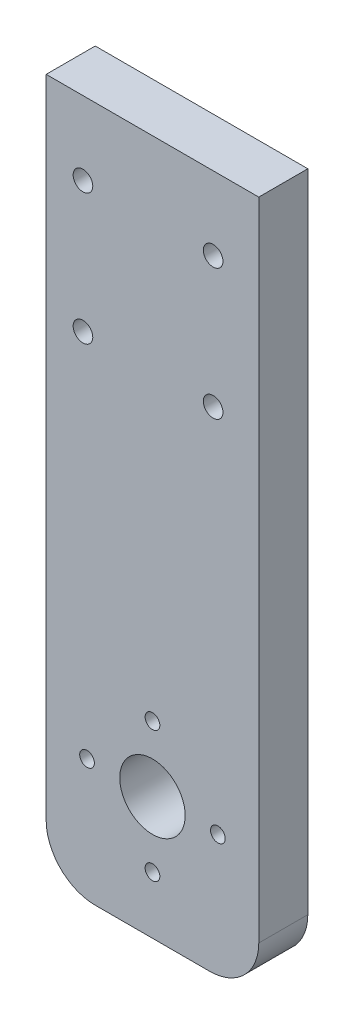
ISO-10303-21;
HEADER;
FILE_DESCRIPTION(('STEP AP214'),'2;1');
FILE_NAME('part.step','',(''),(''),'','','');
FILE_SCHEMA(('AUTOMOTIVE_DESIGN { 1 0 10303 214 1 1 1 1 }'));
ENDSEC;
DATA;
#1=APPLICATION_CONTEXT('core data for automotive mechanical design processes');
#2=APPLICATION_PROTOCOL_DEFINITION('international standard','automotive_design',2000,#1);
#3=PRODUCT_CONTEXT('',#1,'mechanical');
#4=PRODUCT('Part','Part','',(#3));
#5=PRODUCT_RELATED_PRODUCT_CATEGORY('part','',(#4));
#6=PRODUCT_DEFINITION_FORMATION('','',#4);
#7=PRODUCT_DEFINITION_CONTEXT('part definition',#1,'design');
#8=PRODUCT_DEFINITION('design','',#6,#7);
#9=PRODUCT_DEFINITION_SHAPE('','',#8);
#10=(LENGTH_UNIT() NAMED_UNIT(*) SI_UNIT(.MILLI.,.METRE.));
#11=(NAMED_UNIT(*) PLANE_ANGLE_UNIT() SI_UNIT($,.RADIAN.));
#12=(NAMED_UNIT(*) SI_UNIT($,.STERADIAN.) SOLID_ANGLE_UNIT());
#13=UNCERTAINTY_MEASURE_WITH_UNIT(LENGTH_MEASURE(1.E-05),#10,'distance_accuracy_value','');
#14=(GEOMETRIC_REPRESENTATION_CONTEXT(3) GLOBAL_UNCERTAINTY_ASSIGNED_CONTEXT((#13)) GLOBAL_UNIT_ASSIGNED_CONTEXT((#10,
#11,#12)) REPRESENTATION_CONTEXT('',''));
#15=CARTESIAN_POINT('',(0.,0.,0.));
#16=DIRECTION('',(0.,0.,1.));
#17=DIRECTION('',(1.,0.,0.));
#18=AXIS2_PLACEMENT_3D('',#15,#16,#17);
#19=CARTESIAN_POINT('',(44.9164343974426,-77.5734574949968,6.));
#20=DIRECTION('',(0.,0.,1.));
#21=DIRECTION('',(1.,0.,0.));
#22=AXIS2_PLACEMENT_3D('',#19,#20,#21);
#23=PLANE('',#22);
#24=CARTESIAN_POINT('',(29.4164343974426,-23.5734574949968,6.));
#25=DIRECTION('',(0.,0.,1.));
#26=DIRECTION('',(1.,0.,0.));
#27=AXIS2_PLACEMENT_3D('',#24,#25,#26);
#28=CIRCLE('',#27,1.2);
#29=CARTESIAN_POINT('',(30.6164343974426,-23.5734574949968,6.));
#30=VERTEX_POINT('',#29);
#31=EDGE_CURVE('E202',#30,#30,#28,.T.);
#32=ORIENTED_EDGE('',*,*,#31,.F.);
#33=EDGE_LOOP('',(#32));
#34=FACE_BOUND('',#33,.T.);
#35=CARTESIAN_POINT('',(45.3364343974426,-23.5734574949968,6.));
#36=DIRECTION('',(0.,0.,1.));
#37=DIRECTION('',(1.,0.,0.));
#38=AXIS2_PLACEMENT_3D('',#35,#36,#37);
#39=CIRCLE('',#38,1.2);
#40=CARTESIAN_POINT('',(46.5364343974426,-23.5734574949968,6.));
#41=VERTEX_POINT('',#40);
#42=EDGE_CURVE('E212',#41,#41,#39,.T.);
#43=ORIENTED_EDGE('',*,*,#42,.F.);
#44=EDGE_LOOP('',(#43));
#45=FACE_BOUND('',#44,.T.);
#46=CARTESIAN_POINT('',(29.4164343974426,-7.57345749499677,6.));
#47=DIRECTION('',(0.,0.,1.));
#48=DIRECTION('',(1.,0.,0.));
#49=AXIS2_PLACEMENT_3D('',#46,#47,#48);
#50=CIRCLE('',#49,1.2);
#51=CARTESIAN_POINT('',(30.6164343974426,-7.57345749499677,6.));
#52=VERTEX_POINT('',#51);
#53=EDGE_CURVE('E218',#52,#52,#50,.T.);
#54=ORIENTED_EDGE('',*,*,#53,.F.);
#55=EDGE_LOOP('',(#54));
#56=FACE_BOUND('',#55,.T.);
#57=CARTESIAN_POINT('',(45.3364343974426,-7.57345749499677,6.));
#58=DIRECTION('',(0.,0.,1.));
#59=DIRECTION('',(1.,0.,0.));
#60=AXIS2_PLACEMENT_3D('',#57,#58,#59);
#61=CIRCLE('',#60,1.2);
#62=CARTESIAN_POINT('',(46.5364343974426,-7.57345749499677,6.));
#63=VERTEX_POINT('',#62);
#64=EDGE_CURVE('E224',#63,#63,#61,.T.);
#65=ORIENTED_EDGE('',*,*,#64,.F.);
#66=EDGE_LOOP('',(#65));
#67=FACE_BOUND('',#66,.T.);
#68=CARTESIAN_POINT('',(37.9164343974426,-76.5734574949968,6.));
#69=DIRECTION('',(0.,0.,1.));
#70=DIRECTION('',(1.,0.,0.));
#71=AXIS2_PLACEMENT_3D('',#68,#69,#70);
#72=CIRCLE('',#71,0.899999999999996);
#73=CARTESIAN_POINT('',(38.8164343974426,-76.5734574949968,6.));
#74=VERTEX_POINT('',#73);
#75=EDGE_CURVE('E234',#74,#74,#72,.T.);
#76=ORIENTED_EDGE('',*,*,#75,.F.);
#77=EDGE_LOOP('',(#76));
#78=FACE_BOUND('',#77,.T.);
#79=CARTESIAN_POINT('',(37.9164343974426,-60.5734574949968,6.));
#80=DIRECTION('',(0.,0.,1.));
#81=DIRECTION('',(1.,0.,0.));
#82=AXIS2_PLACEMENT_3D('',#79,#80,#81);
#83=CIRCLE('',#82,0.899999999999996);
#84=CARTESIAN_POINT('',(38.8164343974426,-60.5734574949968,6.));
#85=VERTEX_POINT('',#84);
#86=EDGE_CURVE('E246',#85,#85,#83,.T.);
#87=ORIENTED_EDGE('',*,*,#86,.F.);
#88=EDGE_LOOP('',(#87));
#89=FACE_BOUND('',#88,.T.);
#90=CARTESIAN_POINT('',(44.9164343974426,-77.5734574949968,6.));
#91=DIRECTION('',(0.,0.,1.));
#92=DIRECTION('',(1.,0.,0.));
#93=AXIS2_PLACEMENT_3D('',#90,#91,#92);
#94=CIRCLE('',#93,6.);
#95=CARTESIAN_POINT('',(44.9164343974426,-83.5734574949968,6.));
#96=VERTEX_POINT('',#95);
#97=CARTESIAN_POINT('',(50.9164343974426,-77.5734574949968,6.));
#98=VERTEX_POINT('',#97);
#99=EDGE_CURVE('E131',#96,#98,#94,.T.);
#100=ORIENTED_EDGE('',*,*,#99,.T.);
#101=DIRECTION('',(0.,1.,0.));
#102=VECTOR('',#101,1.);
#103=CARTESIAN_POINT('',(50.9164343974426,-77.5734574949968,6.));
#104=LINE('',#103,#102);
#105=CARTESIAN_POINT('',(50.9164343974427,1.42654250500323,6.));
#106=VERTEX_POINT('',#105);
#107=EDGE_CURVE('E89',#98,#106,#104,.T.);
#108=ORIENTED_EDGE('',*,*,#107,.T.);
#109=DIRECTION('',(-1.,0.,0.));
#110=VECTOR('',#109,1.);
#111=CARTESIAN_POINT('',(50.9164343974427,1.42654250500323,6.));
#112=LINE('',#111,#110);
#113=CARTESIAN_POINT('',(24.9164343974426,1.42654250500322,6.));
#114=VERTEX_POINT('',#113);
#115=EDGE_CURVE('E102',#106,#114,#112,.T.);
#116=ORIENTED_EDGE('',*,*,#115,.T.);
#117=DIRECTION('',(0.,-1.,0.));
#118=VECTOR('',#117,1.);
#119=CARTESIAN_POINT('',(24.9164343974426,-77.5734574949968,6.));
#120=LINE('',#119,#118);
#121=CARTESIAN_POINT('',(24.9164343974426,-77.5734574949968,6.));
#122=VERTEX_POINT('',#121);
#123=EDGE_CURVE('E96',#114,#122,#120,.T.);
#124=ORIENTED_EDGE('',*,*,#123,.T.);
#125=CARTESIAN_POINT('',(30.9164343974426,-77.5734574949968,6.));
#126=DIRECTION('',(0.,0.,1.));
#127=DIRECTION('',(1.,0.,0.));
#128=AXIS2_PLACEMENT_3D('',#125,#126,#127);
#129=CIRCLE('',#128,6.);
#130=CARTESIAN_POINT('',(30.9164343974426,-83.5734574949968,6.));
#131=VERTEX_POINT('',#130);
#132=EDGE_CURVE('E100',#122,#131,#129,.T.);
#133=ORIENTED_EDGE('',*,*,#132,.T.);
#134=DIRECTION('',(1.,0.,0.));
#135=VECTOR('',#134,1.);
#136=CARTESIAN_POINT('',(30.9164343974426,-83.5734574949968,6.));
#137=LINE('',#136,#135);
#138=EDGE_CURVE('E52',#131,#96,#137,.T.);
#139=ORIENTED_EDGE('',*,*,#138,.T.);
#140=EDGE_LOOP('',(#100,#108,#116,#124,#133,#139));
#141=FACE_BOUND('',#140,.T.);
#142=CARTESIAN_POINT('',(29.9164343974426,-68.5734574949968,6.));
#143=DIRECTION('',(0.,0.,1.));
#144=DIRECTION('',(1.,0.,0.));
#145=AXIS2_PLACEMENT_3D('',#142,#143,#144);
#146=CIRCLE('',#145,0.899999999999996);
#147=CARTESIAN_POINT('',(30.8164343974426,-68.5734574949968,6.));
#148=VERTEX_POINT('',#147);
#149=EDGE_CURVE('E124',#148,#148,#146,.T.);
#150=ORIENTED_EDGE('',*,*,#149,.F.);
#151=EDGE_LOOP('',(#150));
#152=FACE_BOUND('',#151,.T.);
#153=CARTESIAN_POINT('',(45.9164343974426,-68.5734574949968,6.));
#154=DIRECTION('',(0.,0.,1.));
#155=DIRECTION('',(1.,0.,0.));
#156=AXIS2_PLACEMENT_3D('',#153,#154,#155);
#157=CIRCLE('',#156,0.899999999999996);
#158=CARTESIAN_POINT('',(46.8164343974426,-68.5734574949968,6.));
#159=VERTEX_POINT('',#158);
#160=EDGE_CURVE('E240',#159,#159,#157,.T.);
#161=ORIENTED_EDGE('',*,*,#160,.F.);
#162=EDGE_LOOP('',(#161));
#163=FACE_BOUND('',#162,.T.);
#164=CARTESIAN_POINT('',(37.9164343974426,-68.5734574949968,6.));
#165=DIRECTION('',(0.,0.,1.));
#166=DIRECTION('',(1.,0.,0.));
#167=AXIS2_PLACEMENT_3D('',#164,#165,#166);
#168=CIRCLE('',#167,4.00000000000001);
#169=CARTESIAN_POINT('',(41.9164343974426,-68.5734574949968,6.));
#170=VERTEX_POINT('',#169);
#171=EDGE_CURVE('E228',#170,#170,#168,.T.);
#172=ORIENTED_EDGE('',*,*,#171,.F.);
#173=EDGE_LOOP('',(#172));
#174=FACE_BOUND('',#173,.T.);
#175=ADVANCED_FACE('F35',(#34,#45,#56,#67,#78,#89,#141,#152,#163,#174),#23,.T.);
#176=CARTESIAN_POINT('',(44.9164343974426,-77.5734574949968,0.));
#177=DIRECTION('',(0.,0.,1.));
#178=DIRECTION('',(1.,0.,0.));
#179=AXIS2_PLACEMENT_3D('',#176,#177,#178);
#180=PLANE('',#179);
#181=CARTESIAN_POINT('',(29.4164343974426,-23.5734574949968,0.));
#182=DIRECTION('',(0.,0.,-1.));
#183=DIRECTION('',(-1.,0.,0.));
#184=AXIS2_PLACEMENT_3D('',#181,#182,#183);
#185=CIRCLE('',#184,1.2);
#186=CARTESIAN_POINT('',(28.2164343974426,-23.5734574949968,0.));
#187=VERTEX_POINT('',#186);
#188=EDGE_CURVE('E205',#187,#187,#185,.T.);
#189=ORIENTED_EDGE('',*,*,#188,.F.);
#190=EDGE_LOOP('',(#189));
#191=FACE_BOUND('',#190,.T.);
#192=CARTESIAN_POINT('',(45.3364343974426,-23.5734574949968,0.));
#193=DIRECTION('',(0.,0.,-1.));
#194=DIRECTION('',(-1.,0.,0.));
#195=AXIS2_PLACEMENT_3D('',#192,#193,#194);
#196=CIRCLE('',#195,1.2);
#197=CARTESIAN_POINT('',(44.1364343974426,-23.5734574949968,0.));
#198=VERTEX_POINT('',#197);
#199=EDGE_CURVE('E207',#198,#198,#196,.T.);
#200=ORIENTED_EDGE('',*,*,#199,.F.);
#201=EDGE_LOOP('',(#200));
#202=FACE_BOUND('',#201,.T.);
#203=CARTESIAN_POINT('',(29.4164343974426,-7.57345749499677,0.));
#204=DIRECTION('',(0.,0.,-1.));
#205=DIRECTION('',(-1.,0.,0.));
#206=AXIS2_PLACEMENT_3D('',#203,#204,#205);
#207=CIRCLE('',#206,1.2);
#208=CARTESIAN_POINT('',(28.2164343974426,-7.57345749499677,0.));
#209=VERTEX_POINT('',#208);
#210=EDGE_CURVE('E215',#209,#209,#207,.T.);
#211=ORIENTED_EDGE('',*,*,#210,.F.);
#212=EDGE_LOOP('',(#211));
#213=FACE_BOUND('',#212,.T.);
#214=CARTESIAN_POINT('',(45.3364343974426,-7.57345749499677,0.));
#215=DIRECTION('',(0.,0.,-1.));
#216=DIRECTION('',(-1.,0.,0.));
#217=AXIS2_PLACEMENT_3D('',#214,#215,#216);
#218=CIRCLE('',#217,1.2);
#219=CARTESIAN_POINT('',(44.1364343974426,-7.57345749499677,0.));
#220=VERTEX_POINT('',#219);
#221=EDGE_CURVE('E221',#220,#220,#218,.T.);
#222=ORIENTED_EDGE('',*,*,#221,.F.);
#223=EDGE_LOOP('',(#222));
#224=FACE_BOUND('',#223,.T.);
#225=CARTESIAN_POINT('',(44.9164343974426,-77.5734574949968,0.));
#226=DIRECTION('',(0.,0.,1.));
#227=DIRECTION('',(1.,0.,0.));
#228=AXIS2_PLACEMENT_3D('',#225,#226,#227);
#229=CIRCLE('',#228,6.);
#230=CARTESIAN_POINT('',(44.9164343974426,-83.5734574949968,0.));
#231=VERTEX_POINT('',#230);
#232=CARTESIAN_POINT('',(50.9164343974426,-77.5734574949968,0.));
#233=VERTEX_POINT('',#232);
#234=EDGE_CURVE('E120',#231,#233,#229,.T.);
#235=ORIENTED_EDGE('',*,*,#234,.F.);
#236=DIRECTION('',(1.,0.,0.));
#237=VECTOR('',#236,1.);
#238=CARTESIAN_POINT('',(30.9164343974426,-83.5734574949968,0.));
#239=LINE('',#238,#237);
#240=CARTESIAN_POINT('',(30.9164343974426,-83.5734574949968,0.));
#241=VERTEX_POINT('',#240);
#242=EDGE_CURVE('E81',#241,#231,#239,.T.);
#243=ORIENTED_EDGE('',*,*,#242,.F.);
#244=CARTESIAN_POINT('',(30.9164343974426,-77.5734574949968,0.));
#245=DIRECTION('',(0.,0.,1.));
#246=DIRECTION('',(1.,0.,0.));
#247=AXIS2_PLACEMENT_3D('',#244,#245,#246);
#248=CIRCLE('',#247,6.);
#249=CARTESIAN_POINT('',(24.9164343974426,-77.5734574949968,0.));
#250=VERTEX_POINT('',#249);
#251=EDGE_CURVE('E75',#250,#241,#248,.T.);
#252=ORIENTED_EDGE('',*,*,#251,.F.);
#253=DIRECTION('',(0.,-1.,0.));
#254=VECTOR('',#253,1.);
#255=CARTESIAN_POINT('',(24.9164343974426,-77.5734574949968,0.));
#256=LINE('',#255,#254);
#257=CARTESIAN_POINT('',(24.9164343974426,1.42654250500322,0.));
#258=VERTEX_POINT('',#257);
#259=EDGE_CURVE('E110',#258,#250,#256,.T.);
#260=ORIENTED_EDGE('',*,*,#259,.F.);
#261=DIRECTION('',(-1.,0.,0.));
#262=VECTOR('',#261,1.);
#263=CARTESIAN_POINT('',(50.9164343974427,1.42654250500323,0.));
#264=LINE('',#263,#262);
#265=CARTESIAN_POINT('',(50.9164343974427,1.42654250500323,0.));
#266=VERTEX_POINT('',#265);
#267=EDGE_CURVE('E126',#266,#258,#264,.T.);
#268=ORIENTED_EDGE('',*,*,#267,.F.);
#269=DIRECTION('',(0.,1.,0.));
#270=VECTOR('',#269,1.);
#271=CARTESIAN_POINT('',(50.9164343974426,-77.5734574949968,0.));
#272=LINE('',#271,#270);
#273=EDGE_CURVE('E123',#233,#266,#272,.T.);
#274=ORIENTED_EDGE('',*,*,#273,.F.);
#275=EDGE_LOOP('',(#235,#243,#252,#260,#268,#274));
#276=FACE_BOUND('',#275,.T.);
#277=CARTESIAN_POINT('',(29.9164343974426,-68.5734574949968,0.));
#278=DIRECTION('',(0.,0.,1.));
#279=DIRECTION('',(1.,0.,0.));
#280=AXIS2_PLACEMENT_3D('',#277,#278,#279);
#281=CIRCLE('',#280,0.899999999999996);
#282=CARTESIAN_POINT('',(30.8164343974426,-68.5734574949968,0.));
#283=VERTEX_POINT('',#282);
#284=EDGE_CURVE('E249',#283,#283,#281,.T.);
#285=ORIENTED_EDGE('',*,*,#284,.T.);
#286=EDGE_LOOP('',(#285));
#287=FACE_BOUND('',#286,.T.);
#288=CARTESIAN_POINT('',(37.9164343974426,-60.5734574949968,0.));
#289=DIRECTION('',(0.,0.,1.));
#290=DIRECTION('',(1.,0.,0.));
#291=AXIS2_PLACEMENT_3D('',#288,#289,#290);
#292=CIRCLE('',#291,0.899999999999996);
#293=CARTESIAN_POINT('',(38.8164343974426,-60.5734574949968,0.));
#294=VERTEX_POINT('',#293);
#295=EDGE_CURVE('E243',#294,#294,#292,.T.);
#296=ORIENTED_EDGE('',*,*,#295,.T.);
#297=EDGE_LOOP('',(#296));
#298=FACE_BOUND('',#297,.T.);
#299=CARTESIAN_POINT('',(45.9164343974426,-68.5734574949968,0.));
#300=DIRECTION('',(0.,0.,1.));
#301=DIRECTION('',(1.,0.,0.));
#302=AXIS2_PLACEMENT_3D('',#299,#300,#301);
#303=CIRCLE('',#302,0.899999999999996);
#304=CARTESIAN_POINT('',(46.8164343974426,-68.5734574949968,0.));
#305=VERTEX_POINT('',#304);
#306=EDGE_CURVE('E237',#305,#305,#303,.T.);
#307=ORIENTED_EDGE('',*,*,#306,.T.);
#308=EDGE_LOOP('',(#307));
#309=FACE_BOUND('',#308,.T.);
#310=CARTESIAN_POINT('',(37.9164343974426,-76.5734574949968,0.));
#311=DIRECTION('',(0.,0.,1.));
#312=DIRECTION('',(1.,0.,0.));
#313=AXIS2_PLACEMENT_3D('',#310,#311,#312);
#314=CIRCLE('',#313,0.899999999999996);
#315=CARTESIAN_POINT('',(38.8164343974426,-76.5734574949968,0.));
#316=VERTEX_POINT('',#315);
#317=EDGE_CURVE('E231',#316,#316,#314,.T.);
#318=ORIENTED_EDGE('',*,*,#317,.T.);
#319=EDGE_LOOP('',(#318));
#320=FACE_BOUND('',#319,.T.);
#321=CARTESIAN_POINT('',(37.9164343974426,-68.5734574949968,0.));
#322=DIRECTION('',(0.,0.,1.));
#323=DIRECTION('',(1.,0.,0.));
#324=AXIS2_PLACEMENT_3D('',#321,#322,#323);
#325=CIRCLE('',#324,4.00000000000001);
#326=CARTESIAN_POINT('',(41.9164343974426,-68.5734574949968,0.));
#327=VERTEX_POINT('',#326);
#328=EDGE_CURVE('E227',#327,#327,#325,.T.);
#329=ORIENTED_EDGE('',*,*,#328,.T.);
#330=EDGE_LOOP('',(#329));
#331=FACE_BOUND('',#330,.T.);
#332=ADVANCED_FACE('F140',(#191,#202,#213,#224,#276,#287,#298,#309,#320,#331),#180,.F.);
#333=CARTESIAN_POINT('',(44.9164343974426,-77.5734574949968,6.));
#334=DIRECTION('',(0.,0.,-1.));
#335=DIRECTION('',(-1.,0.,0.));
#336=AXIS2_PLACEMENT_3D('',#333,#334,#335);
#337=CYLINDRICAL_SURFACE('',#336,6.);
#338=ORIENTED_EDGE('',*,*,#234,.T.);
#339=DIRECTION('',(0.,0.,-1.));
#340=VECTOR('',#339,1.);
#341=CARTESIAN_POINT('',(50.9164343974426,-77.5734574949968,6.));
#342=LINE('',#341,#340);
#343=EDGE_CURVE('E11',#98,#233,#342,.T.);
#344=ORIENTED_EDGE('',*,*,#343,.F.);
#345=ORIENTED_EDGE('',*,*,#99,.F.);
#346=DIRECTION('',(0.,0.,-1.));
#347=VECTOR('',#346,1.);
#348=CARTESIAN_POINT('',(44.9164343974426,-83.5734574949968,6.));
#349=LINE('',#348,#347);
#350=EDGE_CURVE('E116',#96,#231,#349,.T.);
#351=ORIENTED_EDGE('',*,*,#350,.T.);
#352=EDGE_LOOP('',(#338,#344,#345,#351));
#353=FACE_BOUND('',#352,.T.);
#354=ADVANCED_FACE('F37',(#353),#337,.T.);
#355=CARTESIAN_POINT('',(50.9164343974426,-77.5734574949968,6.));
#356=DIRECTION('',(-1.,0.,0.));
#357=DIRECTION('',(0.,-1.,0.));
#358=AXIS2_PLACEMENT_3D('',#355,#356,#357);
#359=PLANE('',#358);
#360=ORIENTED_EDGE('',*,*,#273,.T.);
#361=DIRECTION('',(0.,0.,-1.));
#362=VECTOR('',#361,1.);
#363=CARTESIAN_POINT('',(50.9164343974427,1.42654250500323,6.));
#364=LINE('',#363,#362);
#365=EDGE_CURVE('E44',#106,#266,#364,.T.);
#366=ORIENTED_EDGE('',*,*,#365,.F.);
#367=ORIENTED_EDGE('',*,*,#107,.F.);
#368=ORIENTED_EDGE('',*,*,#343,.T.);
#369=EDGE_LOOP('',(#360,#366,#367,#368));
#370=FACE_BOUND('',#369,.T.);
#371=ADVANCED_FACE('F354',(#370),#359,.F.);
#372=CARTESIAN_POINT('',(50.9164343974427,1.42654250500323,6.));
#373=DIRECTION('',(0.,-1.,0.));
#374=DIRECTION('',(1.,0.,0.));
#375=AXIS2_PLACEMENT_3D('',#372,#373,#374);
#376=PLANE('',#375);
#377=ORIENTED_EDGE('',*,*,#267,.T.);
#378=DIRECTION('',(0.,0.,-1.));
#379=VECTOR('',#378,1.);
#380=CARTESIAN_POINT('',(24.9164343974426,1.42654250500322,6.));
#381=LINE('',#380,#379);
#382=EDGE_CURVE('E111',#114,#258,#381,.T.);
#383=ORIENTED_EDGE('',*,*,#382,.F.);
#384=ORIENTED_EDGE('',*,*,#115,.F.);
#385=ORIENTED_EDGE('',*,*,#365,.T.);
#386=EDGE_LOOP('',(#377,#383,#384,#385));
#387=FACE_BOUND('',#386,.T.);
#388=ADVANCED_FACE('F137',(#387),#376,.F.);
#389=CARTESIAN_POINT('',(24.9164343974426,-77.5734574949968,6.));
#390=DIRECTION('',(1.,0.,0.));
#391=DIRECTION('',(0.,1.,0.));
#392=AXIS2_PLACEMENT_3D('',#389,#390,#391);
#393=PLANE('',#392);
#394=ORIENTED_EDGE('',*,*,#259,.T.);
#395=DIRECTION('',(0.,0.,-1.));
#396=VECTOR('',#395,1.);
#397=CARTESIAN_POINT('',(24.9164343974426,-77.5734574949968,6.));
#398=LINE('',#397,#396);
#399=EDGE_CURVE('E107',#122,#250,#398,.T.);
#400=ORIENTED_EDGE('',*,*,#399,.F.);
#401=ORIENTED_EDGE('',*,*,#123,.F.);
#402=ORIENTED_EDGE('',*,*,#382,.T.);
#403=EDGE_LOOP('',(#394,#400,#401,#402));
#404=FACE_BOUND('',#403,.T.);
#405=ADVANCED_FACE('F108',(#404),#393,.F.);
#406=CARTESIAN_POINT('',(30.9164343974426,-77.5734574949968,6.));
#407=DIRECTION('',(0.,0.,-1.));
#408=DIRECTION('',(-1.,0.,0.));
#409=AXIS2_PLACEMENT_3D('',#406,#407,#408);
#410=CYLINDRICAL_SURFACE('',#409,6.);
#411=ORIENTED_EDGE('',*,*,#251,.T.);
#412=DIRECTION('',(0.,0.,-1.));
#413=VECTOR('',#412,1.);
#414=CARTESIAN_POINT('',(30.9164343974426,-83.5734574949968,6.));
#415=LINE('',#414,#413);
#416=EDGE_CURVE('E112',#131,#241,#415,.T.);
#417=ORIENTED_EDGE('',*,*,#416,.F.);
#418=ORIENTED_EDGE('',*,*,#132,.F.);
#419=ORIENTED_EDGE('',*,*,#399,.T.);
#420=EDGE_LOOP('',(#411,#417,#418,#419));
#421=FACE_BOUND('',#420,.T.);
#422=ADVANCED_FACE('F114',(#421),#410,.T.);
#423=CARTESIAN_POINT('',(30.9164343974426,-83.5734574949968,6.));
#424=DIRECTION('',(0.,1.,0.));
#425=DIRECTION('',(0.,0.,1.));
#426=AXIS2_PLACEMENT_3D('',#423,#424,#425);
#427=PLANE('',#426);
#428=ORIENTED_EDGE('',*,*,#242,.T.);
#429=ORIENTED_EDGE('',*,*,#350,.F.);
#430=ORIENTED_EDGE('',*,*,#138,.F.);
#431=ORIENTED_EDGE('',*,*,#416,.T.);
#432=EDGE_LOOP('',(#428,#429,#430,#431));
#433=FACE_BOUND('',#432,.T.);
#434=ADVANCED_FACE('F145',(#433),#427,.F.);
#435=CARTESIAN_POINT('',(29.9164343974426,-68.5734574949968,6.));
#436=DIRECTION('',(0.,0.,-1.));
#437=DIRECTION('',(-1.,0.,0.));
#438=AXIS2_PLACEMENT_3D('',#435,#436,#437);
#439=CYLINDRICAL_SURFACE('',#438,0.899999999999996);
#440=ORIENTED_EDGE('',*,*,#149,.T.);
#441=EDGE_LOOP('',(#440));
#442=FACE_BOUND('',#441,.T.);
#443=ORIENTED_EDGE('',*,*,#284,.F.);
#444=EDGE_LOOP('',(#443));
#445=FACE_BOUND('',#444,.T.);
#446=ADVANCED_FACE('F147',(#442,#445),#439,.F.);
#447=CARTESIAN_POINT('',(37.9164343974426,-60.5734574949968,6.));
#448=DIRECTION('',(0.,0.,-1.));
#449=DIRECTION('',(-1.,0.,0.));
#450=AXIS2_PLACEMENT_3D('',#447,#448,#449);
#451=CYLINDRICAL_SURFACE('',#450,0.899999999999996);
#452=ORIENTED_EDGE('',*,*,#86,.T.);
#453=EDGE_LOOP('',(#452));
#454=FACE_BOUND('',#453,.T.);
#455=ORIENTED_EDGE('',*,*,#295,.F.);
#456=EDGE_LOOP('',(#455));
#457=FACE_BOUND('',#456,.T.);
#458=ADVANCED_FACE('F153',(#454,#457),#451,.F.);
#459=CARTESIAN_POINT('',(45.9164343974426,-68.5734574949968,6.));
#460=DIRECTION('',(0.,0.,-1.));
#461=DIRECTION('',(-1.,0.,0.));
#462=AXIS2_PLACEMENT_3D('',#459,#460,#461);
#463=CYLINDRICAL_SURFACE('',#462,0.899999999999996);
#464=ORIENTED_EDGE('',*,*,#160,.T.);
#465=EDGE_LOOP('',(#464));
#466=FACE_BOUND('',#465,.T.);
#467=ORIENTED_EDGE('',*,*,#306,.F.);
#468=EDGE_LOOP('',(#467));
#469=FACE_BOUND('',#468,.T.);
#470=ADVANCED_FACE('F170',(#466,#469),#463,.F.);
#471=CARTESIAN_POINT('',(37.9164343974426,-76.5734574949968,6.));
#472=DIRECTION('',(0.,0.,-1.));
#473=DIRECTION('',(-1.,0.,0.));
#474=AXIS2_PLACEMENT_3D('',#471,#472,#473);
#475=CYLINDRICAL_SURFACE('',#474,0.899999999999996);
#476=ORIENTED_EDGE('',*,*,#75,.T.);
#477=EDGE_LOOP('',(#476));
#478=FACE_BOUND('',#477,.T.);
#479=ORIENTED_EDGE('',*,*,#317,.F.);
#480=EDGE_LOOP('',(#479));
#481=FACE_BOUND('',#480,.T.);
#482=ADVANCED_FACE('F174',(#478,#481),#475,.F.);
#483=CARTESIAN_POINT('',(37.9164343974426,-68.5734574949968,6.));
#484=DIRECTION('',(0.,0.,-1.));
#485=DIRECTION('',(-1.,0.,0.));
#486=AXIS2_PLACEMENT_3D('',#483,#484,#485);
#487=CYLINDRICAL_SURFACE('',#486,4.00000000000001);
#488=ORIENTED_EDGE('',*,*,#171,.T.);
#489=EDGE_LOOP('',(#488));
#490=FACE_BOUND('',#489,.T.);
#491=ORIENTED_EDGE('',*,*,#328,.F.);
#492=EDGE_LOOP('',(#491));
#493=FACE_BOUND('',#492,.T.);
#494=ADVANCED_FACE('F178',(#490,#493),#487,.F.);
#495=CARTESIAN_POINT('',(45.3364343974426,-7.57345749499677,10.));
#496=DIRECTION('',(0.,0.,-1.));
#497=DIRECTION('',(-1.,0.,0.));
#498=AXIS2_PLACEMENT_3D('',#495,#496,#497);
#499=CYLINDRICAL_SURFACE('',#498,1.2);
#500=ORIENTED_EDGE('',*,*,#64,.T.);
#501=EDGE_LOOP('',(#500));
#502=FACE_BOUND('',#501,.T.);
#503=ORIENTED_EDGE('',*,*,#221,.T.);
#504=EDGE_LOOP('',(#503));
#505=FACE_BOUND('',#504,.T.);
#506=ADVANCED_FACE('F182',(#502,#505),#499,.F.);
#507=CARTESIAN_POINT('',(29.4164343974426,-7.57345749499677,10.));
#508=DIRECTION('',(0.,0.,-1.));
#509=DIRECTION('',(-1.,0.,0.));
#510=AXIS2_PLACEMENT_3D('',#507,#508,#509);
#511=CYLINDRICAL_SURFACE('',#510,1.2);
#512=ORIENTED_EDGE('',*,*,#53,.T.);
#513=EDGE_LOOP('',(#512));
#514=FACE_BOUND('',#513,.T.);
#515=ORIENTED_EDGE('',*,*,#210,.T.);
#516=EDGE_LOOP('',(#515));
#517=FACE_BOUND('',#516,.T.);
#518=ADVANCED_FACE('F186',(#514,#517),#511,.F.);
#519=CARTESIAN_POINT('',(45.3364343974426,-23.5734574949968,10.));
#520=DIRECTION('',(0.,0.,-1.));
#521=DIRECTION('',(-1.,0.,0.));
#522=AXIS2_PLACEMENT_3D('',#519,#520,#521);
#523=CYLINDRICAL_SURFACE('',#522,1.2);
#524=ORIENTED_EDGE('',*,*,#42,.T.);
#525=EDGE_LOOP('',(#524));
#526=FACE_BOUND('',#525,.T.);
#527=ORIENTED_EDGE('',*,*,#199,.T.);
#528=EDGE_LOOP('',(#527));
#529=FACE_BOUND('',#528,.T.);
#530=ADVANCED_FACE('F190',(#526,#529),#523,.F.);
#531=CARTESIAN_POINT('',(29.4164343974426,-23.5734574949968,10.));
#532=DIRECTION('',(0.,0.,-1.));
#533=DIRECTION('',(-1.,0.,0.));
#534=AXIS2_PLACEMENT_3D('',#531,#532,#533);
#535=CYLINDRICAL_SURFACE('',#534,1.2);
#536=ORIENTED_EDGE('',*,*,#31,.T.);
#537=EDGE_LOOP('',(#536));
#538=FACE_BOUND('',#537,.T.);
#539=ORIENTED_EDGE('',*,*,#188,.T.);
#540=EDGE_LOOP('',(#539));
#541=FACE_BOUND('',#540,.T.);
#542=ADVANCED_FACE('F194',(#538,#541),#535,.F.);
#543=CLOSED_SHELL('',(#175,#332,#354,#371,#388,#405,#422,#434,#446,#458,#470,#482,#494,#506,
#518,#530,#542));
#544=MANIFOLD_SOLID_BREP('B2',#543);
#545=ADVANCED_BREP_SHAPE_REPRESENTATION('',(#18,#544),#14);
#546=SHAPE_DEFINITION_REPRESENTATION(#9,#545);
ENDSEC;
END-ISO-10303-21;
